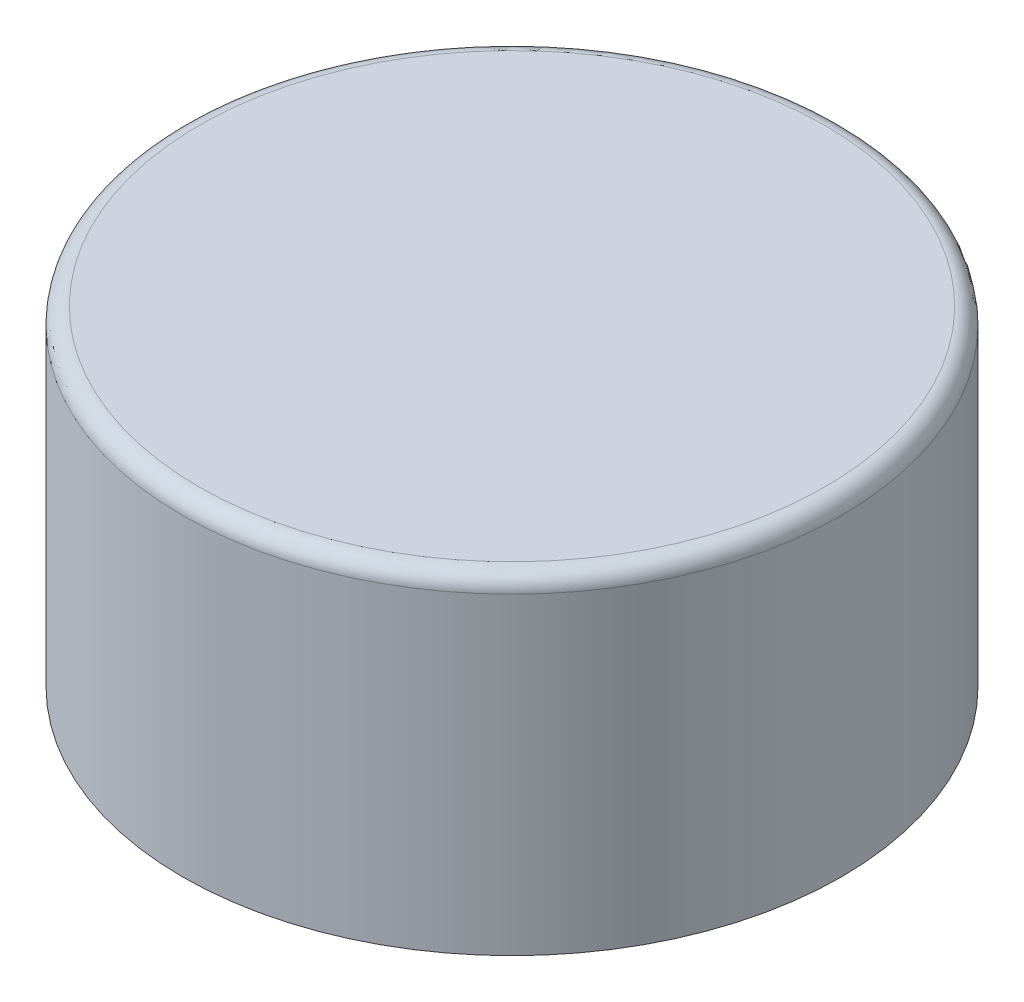
ISO-10303-21;
HEADER;
FILE_DESCRIPTION(('STEP AP214'),'2;1');
FILE_NAME('part.step','',(''),(''),'','','');
FILE_SCHEMA(('AUTOMOTIVE_DESIGN { 1 0 10303 214 1 1 1 1 }'));
ENDSEC;
DATA;
#1=APPLICATION_CONTEXT('core data for automotive mechanical design processes');
#2=APPLICATION_PROTOCOL_DEFINITION('international standard','automotive_design',2000,#1);
#3=PRODUCT_CONTEXT('',#1,'mechanical');
#4=PRODUCT('Part','Part','',(#3));
#5=PRODUCT_RELATED_PRODUCT_CATEGORY('part','',(#4));
#6=PRODUCT_DEFINITION_FORMATION('','',#4);
#7=PRODUCT_DEFINITION_CONTEXT('part definition',#1,'design');
#8=PRODUCT_DEFINITION('design','',#6,#7);
#9=PRODUCT_DEFINITION_SHAPE('','',#8);
#10=(LENGTH_UNIT() NAMED_UNIT(*) SI_UNIT(.MILLI.,.METRE.));
#11=(NAMED_UNIT(*) PLANE_ANGLE_UNIT() SI_UNIT($,.RADIAN.));
#12=(NAMED_UNIT(*) SI_UNIT($,.STERADIAN.) SOLID_ANGLE_UNIT());
#13=UNCERTAINTY_MEASURE_WITH_UNIT(LENGTH_MEASURE(1.E-05),#10,'distance_accuracy_value','');
#14=(GEOMETRIC_REPRESENTATION_CONTEXT(3) GLOBAL_UNCERTAINTY_ASSIGNED_CONTEXT((#13)) GLOBAL_UNIT_ASSIGNED_CONTEXT((#10,
#11,#12)) REPRESENTATION_CONTEXT('',''));
#15=CARTESIAN_POINT('',(0.,0.,0.));
#16=DIRECTION('',(0.,0.,1.));
#17=DIRECTION('',(1.,0.,0.));
#18=AXIS2_PLACEMENT_3D('',#15,#16,#17);
#19=CARTESIAN_POINT('',(0.,0.,0.));
#20=DIRECTION('',(0.,1.,0.));
#21=DIRECTION('',(0.,0.,1.));
#22=AXIS2_PLACEMENT_3D('',#19,#20,#21);
#23=PLANE('',#22);
#24=CARTESIAN_POINT('',(0.,0.,0.));
#25=DIRECTION('',(0.,1.,0.));
#26=DIRECTION('',(0.,0.,1.));
#27=AXIS2_PLACEMENT_3D('',#24,#25,#26);
#28=CIRCLE('',#27,40.);
#29=CARTESIAN_POINT('',(0.,0.,40.));
#30=VERTEX_POINT('',#29);
#31=EDGE_CURVE('E64',#30,#30,#28,.T.);
#32=ORIENTED_EDGE('',*,*,#31,.F.);
#33=EDGE_LOOP('',(#32));
#34=FACE_BOUND('',#33,.T.);
#35=CARTESIAN_POINT('',(0.,0.,0.));
#36=DIRECTION('',(0.,1.,0.));
#37=DIRECTION('',(0.,0.,1.));
#38=AXIS2_PLACEMENT_3D('',#35,#36,#37);
#39=CIRCLE('',#38,9.75);
#40=CARTESIAN_POINT('',(0.,0.,-9.75));
#41=VERTEX_POINT('',#40);
#42=EDGE_CURVE('E12',#41,#41,#39,.T.);
#43=ORIENTED_EDGE('',*,*,#42,.T.);
#44=EDGE_LOOP('',(#43));
#45=FACE_BOUND('',#44,.T.);
#46=ADVANCED_FACE('F46',(#34,#45),#23,.F.);
#47=CARTESIAN_POINT('',(0.,40.,0.));
#48=DIRECTION('',(0.,-1.,0.));
#49=DIRECTION('',(0.,0.,-1.));
#50=AXIS2_PLACEMENT_3D('',#47,#48,#49);
#51=CYLINDRICAL_SURFACE('',#50,40.);
#52=CARTESIAN_POINT('',(0.,38.,0.));
#53=DIRECTION('',(0.,1.,0.));
#54=DIRECTION('',(0.,0.,1.));
#55=AXIS2_PLACEMENT_3D('',#52,#53,#54);
#56=CIRCLE('',#55,40.);
#57=CARTESIAN_POINT('',(0.,38.,40.));
#58=VERTEX_POINT('',#57);
#59=EDGE_CURVE('E77',#58,#58,#56,.F.);
#60=ORIENTED_EDGE('',*,*,#59,.T.);
#61=EDGE_LOOP('',(#60));
#62=FACE_BOUND('',#61,.T.);
#63=ORIENTED_EDGE('',*,*,#31,.T.);
#64=EDGE_LOOP('',(#63));
#65=FACE_BOUND('',#64,.T.);
#66=ADVANCED_FACE('F96',(#62,#65),#51,.T.);
#67=CARTESIAN_POINT('',(0.,40.,0.));
#68=DIRECTION('',(0.,1.,0.));
#69=DIRECTION('',(0.,0.,1.));
#70=AXIS2_PLACEMENT_3D('',#67,#68,#69);
#71=PLANE('',#70);
#72=CARTESIAN_POINT('',(0.,40.,0.));
#73=DIRECTION('',(0.,1.,0.));
#74=DIRECTION('',(0.,0.,1.));
#75=AXIS2_PLACEMENT_3D('',#72,#73,#74);
#76=CIRCLE('',#75,38.);
#77=CARTESIAN_POINT('',(0.,40.,38.));
#78=VERTEX_POINT('',#77);
#79=EDGE_CURVE('E68',#78,#78,#76,.T.);
#80=ORIENTED_EDGE('',*,*,#79,.T.);
#81=EDGE_LOOP('',(#80));
#82=FACE_BOUND('',#81,.T.);
#83=ADVANCED_FACE('F101',(#82),#71,.T.);
#84=CARTESIAN_POINT('',(0.,38.,0.));
#85=DIRECTION('',(0.,1.,0.));
#86=DIRECTION('',(0.,0.,1.));
#87=AXIS2_PLACEMENT_3D('',#84,#85,#86);
#88=TOROIDAL_SURFACE('',#87,38.,2.);
#89=ORIENTED_EDGE('',*,*,#59,.F.);
#90=EDGE_LOOP('',(#89));
#91=FACE_BOUND('',#90,.T.);
#92=ORIENTED_EDGE('',*,*,#79,.F.);
#93=EDGE_LOOP('',(#92));
#94=FACE_BOUND('',#93,.T.);
#95=ADVANCED_FACE('F48',(#91,#94),#88,.T.);
#96=CARTESIAN_POINT('',(0.,0.,0.));
#97=DIRECTION('',(0.,-1.,0.));
#98=DIRECTION('',(0.,0.,-1.));
#99=AXIS2_PLACEMENT_3D('',#96,#97,#98);
#100=TOROIDAL_SURFACE('',#99,9.,0.750000000000001);
#101=CARTESIAN_POINT('',(0.,0.,-9.));
#102=DIRECTION('',(1.,0.,0.));
#103=DIRECTION('',(0.,0.,-1.));
#104=AXIS2_PLACEMENT_3D('',#101,#102,#103);
#105=CIRCLE('',#104,0.750000000000001);
#106=CARTESIAN_POINT('',(0.,0.,-8.25));
#107=VERTEX_POINT('',#106);
#108=EDGE_CURVE('E61',#41,#107,#105,.T.);
#109=ORIENTED_EDGE('',*,*,#108,.T.);
#110=CARTESIAN_POINT('',(0.,0.,0.));
#111=DIRECTION('',(0.,-1.,0.));
#112=DIRECTION('',(0.,0.,-1.));
#113=AXIS2_PLACEMENT_3D('',#110,#111,#112);
#114=CIRCLE('',#113,8.25);
#115=EDGE_CURVE('E54',#107,#107,#114,.T.);
#116=ORIENTED_EDGE('',*,*,#115,.F.);
#117=ORIENTED_EDGE('',*,*,#108,.F.);
#118=ORIENTED_EDGE('',*,*,#42,.F.);
#119=EDGE_LOOP('',(#109,#116,#117,#118));
#120=FACE_BOUND('',#119,.T.);
#121=ADVANCED_FACE('F62',(#120),#100,.F.);
#122=CARTESIAN_POINT('',(0.,0.,0.));
#123=DIRECTION('',(0.,-1.,0.));
#124=DIRECTION('',(0.,0.,-1.));
#125=AXIS2_PLACEMENT_3D('',#122,#123,#124);
#126=CIRCLE('',#125,0.5);
#127=CARTESIAN_POINT('',(0.,0.,-0.5));
#128=VERTEX_POINT('',#127);
#129=EDGE_CURVE('E71',#128,#128,#126,.T.);
#130=ORIENTED_EDGE('',*,*,#129,.F.);
#131=EDGE_LOOP('',(#130));
#132=FACE_BOUND('',#131,.T.);
#133=ORIENTED_EDGE('',*,*,#115,.T.);
#134=EDGE_LOOP('',(#133));
#135=FACE_BOUND('',#134,.T.);
#136=ADVANCED_FACE('F80',(#132,#135),#23,.F.);
#137=CARTESIAN_POINT('',(0.,1.,0.));
#138=DIRECTION('',(0.,1.,0.));
#139=DIRECTION('',(0.,0.,1.));
#140=AXIS2_PLACEMENT_3D('',#137,#138,#139);
#141=PLANE('',#140);
#142=CARTESIAN_POINT('',(0.,1.,0.));
#143=DIRECTION('',(0.,-1.,0.));
#144=DIRECTION('',(0.,0.,-1.));
#145=AXIS2_PLACEMENT_3D('',#142,#143,#144);
#146=CIRCLE('',#145,0.5);
#147=CARTESIAN_POINT('',(0.,1.,-0.5));
#148=VERTEX_POINT('',#147);
#149=EDGE_CURVE('E65',#148,#148,#146,.T.);
#150=ORIENTED_EDGE('',*,*,#149,.T.);
#151=EDGE_LOOP('',(#150));
#152=FACE_BOUND('',#151,.T.);
#153=ADVANCED_FACE('F82',(#152),#141,.F.);
#154=CARTESIAN_POINT('',(0.,0.,0.));
#155=DIRECTION('',(0.,-1.,0.));
#156=DIRECTION('',(0.,0.,-1.));
#157=AXIS2_PLACEMENT_3D('',#154,#155,#156);
#158=CYLINDRICAL_SURFACE('',#157,0.5);
#159=ORIENTED_EDGE('',*,*,#149,.F.);
#160=EDGE_LOOP('',(#159));
#161=FACE_BOUND('',#160,.T.);
#162=ORIENTED_EDGE('',*,*,#129,.T.);
#163=EDGE_LOOP('',(#162));
#164=FACE_BOUND('',#163,.T.);
#165=ADVANCED_FACE('F89',(#161,#164),#158,.F.);
#166=CLOSED_SHELL('',(#46,#66,#83,#95,#121,#136,#153,#165));
#167=MANIFOLD_SOLID_BREP('B2',#166);
#168=ADVANCED_BREP_SHAPE_REPRESENTATION('',(#18,#167),#14);
#169=SHAPE_DEFINITION_REPRESENTATION(#9,#168);
ENDSEC;
END-ISO-10303-21;
